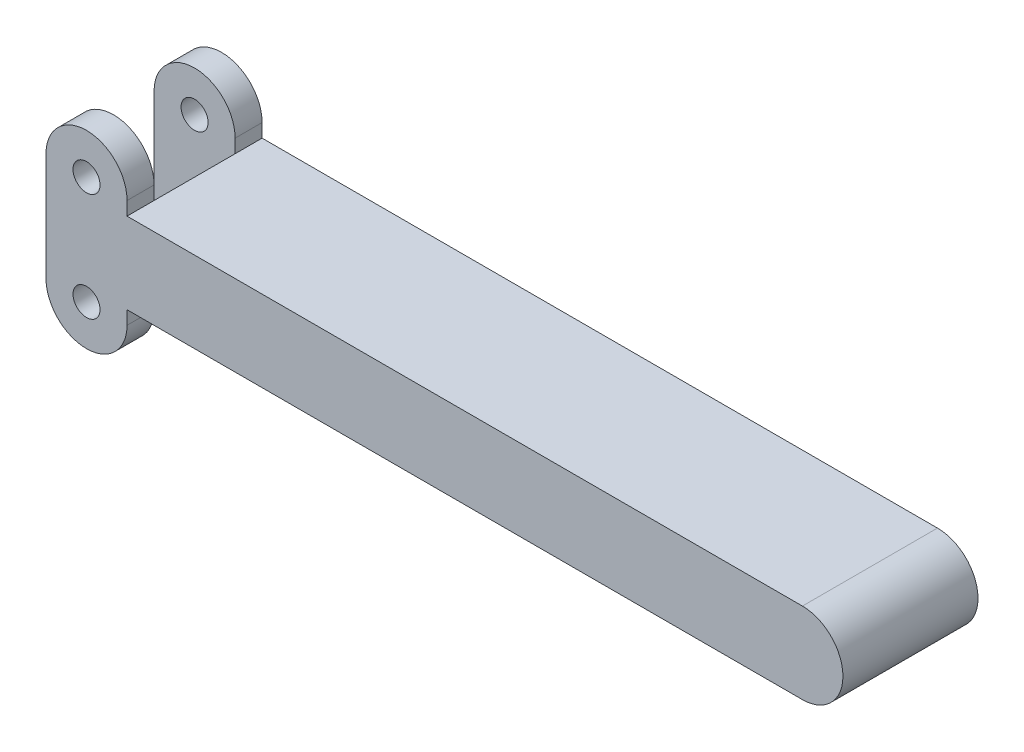
ISO-10303-21;
HEADER;
FILE_DESCRIPTION(('STEP AP214'),'2;1');
FILE_NAME('part.step','',(''),(''),'','','');
FILE_SCHEMA(('AUTOMOTIVE_DESIGN { 1 0 10303 214 1 1 1 1 }'));
ENDSEC;
DATA;
#1=APPLICATION_CONTEXT('core data for automotive mechanical design processes');
#2=APPLICATION_PROTOCOL_DEFINITION('international standard','automotive_design',2000,#1);
#3=PRODUCT_CONTEXT('',#1,'mechanical');
#4=PRODUCT('Part','Part','',(#3));
#5=PRODUCT_RELATED_PRODUCT_CATEGORY('part','',(#4));
#6=PRODUCT_DEFINITION_FORMATION('','',#4);
#7=PRODUCT_DEFINITION_CONTEXT('part definition',#1,'design');
#8=PRODUCT_DEFINITION('design','',#6,#7);
#9=PRODUCT_DEFINITION_SHAPE('','',#8);
#10=(LENGTH_UNIT() NAMED_UNIT(*) SI_UNIT(.MILLI.,.METRE.));
#11=(NAMED_UNIT(*) PLANE_ANGLE_UNIT() SI_UNIT($,.RADIAN.));
#12=(NAMED_UNIT(*) SI_UNIT($,.STERADIAN.) SOLID_ANGLE_UNIT());
#13=UNCERTAINTY_MEASURE_WITH_UNIT(LENGTH_MEASURE(1.E-05),#10,'distance_accuracy_value','');
#14=(GEOMETRIC_REPRESENTATION_CONTEXT(3) GLOBAL_UNCERTAINTY_ASSIGNED_CONTEXT((#13)) GLOBAL_UNIT_ASSIGNED_CONTEXT((#10,
#11,#12)) REPRESENTATION_CONTEXT('',''));
#15=CARTESIAN_POINT('',(0.,0.,0.));
#16=DIRECTION('',(0.,0.,1.));
#17=DIRECTION('',(1.,0.,0.));
#18=AXIS2_PLACEMENT_3D('',#15,#16,#17);
#19=CARTESIAN_POINT('',(9.525,0.,31.75));
#20=DIRECTION('',(-1.,0.,0.));
#21=DIRECTION('',(0.,-1.,0.));
#22=AXIS2_PLACEMENT_3D('',#19,#20,#21);
#23=PLANE('',#22);
#24=DIRECTION('',(0.,-1.,0.));
#25=VECTOR('',#24,1.);
#26=CARTESIAN_POINT('',(9.525,0.,25.4));
#27=LINE('',#26,#25);
#28=CARTESIAN_POINT('',(9.525,25.4,25.4));
#29=VERTEX_POINT('',#28);
#30=CARTESIAN_POINT('',(9.525,22.225,25.4));
#31=VERTEX_POINT('',#30);
#32=EDGE_CURVE('E188',#29,#31,#27,.T.);
#33=ORIENTED_EDGE('',*,*,#32,.F.);
#34=DIRECTION('',(0.,0.,-1.));
#35=VECTOR('',#34,1.);
#36=CARTESIAN_POINT('',(9.525,25.4,31.75));
#37=LINE('',#36,#35);
#38=CARTESIAN_POINT('',(9.525,25.4,31.75));
#39=VERTEX_POINT('',#38);
#40=EDGE_CURVE('E213',#39,#29,#37,.T.);
#41=ORIENTED_EDGE('',*,*,#40,.F.);
#42=DIRECTION('',(0.,1.,0.));
#43=VECTOR('',#42,1.);
#44=CARTESIAN_POINT('',(9.525,0.,31.75));
#45=LINE('',#44,#43);
#46=CARTESIAN_POINT('',(9.525,22.225,31.75));
#47=VERTEX_POINT('',#46);
#48=EDGE_CURVE('E141',#47,#39,#45,.T.);
#49=ORIENTED_EDGE('',*,*,#48,.F.);
#50=DIRECTION('',(0.,0.,-1.));
#51=VECTOR('',#50,1.);
#52=CARTESIAN_POINT('',(9.525,22.225,31.75));
#53=LINE('',#52,#51);
#54=EDGE_CURVE('E44',#47,#31,#53,.T.);
#55=ORIENTED_EDGE('',*,*,#54,.T.);
#56=EDGE_LOOP('',(#33,#41,#49,#55));
#57=FACE_BOUND('',#56,.T.);
#58=ADVANCED_FACE('F35',(#57),#23,.F.);
#59=CARTESIAN_POINT('',(0.,25.4,31.75));
#60=DIRECTION('',(0.,0.,-1.));
#61=DIRECTION('',(-1.,0.,0.));
#62=AXIS2_PLACEMENT_3D('',#59,#60,#61);
#63=CYLINDRICAL_SURFACE('',#62,9.525);
#64=CARTESIAN_POINT('',(0.,25.4,25.4));
#65=DIRECTION('',(0.,0.,-1.));
#66=DIRECTION('',(0.,1.,0.));
#67=AXIS2_PLACEMENT_3D('',#64,#65,#66);
#68=CIRCLE('',#67,9.525);
#69=CARTESIAN_POINT('',(-9.525,25.4,25.4));
#70=VERTEX_POINT('',#69);
#71=EDGE_CURVE('E161',#70,#29,#68,.T.);
#72=ORIENTED_EDGE('',*,*,#71,.F.);
#73=DIRECTION('',(0.,0.,-1.));
#74=VECTOR('',#73,1.);
#75=CARTESIAN_POINT('',(-9.52500000000001,25.4,31.75));
#76=LINE('',#75,#74);
#77=CARTESIAN_POINT('',(-9.52500000000001,25.4,31.75));
#78=VERTEX_POINT('',#77);
#79=EDGE_CURVE('E259',#78,#70,#76,.T.);
#80=ORIENTED_EDGE('',*,*,#79,.F.);
#81=CARTESIAN_POINT('',(0.,25.4,31.75));
#82=DIRECTION('',(0.,0.,1.));
#83=DIRECTION('',(1.,0.,0.));
#84=AXIS2_PLACEMENT_3D('',#81,#82,#83);
#85=CIRCLE('',#84,9.525);
#86=EDGE_CURVE('E146',#39,#78,#85,.T.);
#87=ORIENTED_EDGE('',*,*,#86,.F.);
#88=ORIENTED_EDGE('',*,*,#40,.T.);
#89=EDGE_LOOP('',(#72,#80,#87,#88));
#90=FACE_BOUND('',#89,.T.);
#91=ADVANCED_FACE('F315',(#90),#63,.T.);
#92=CARTESIAN_POINT('',(0.,25.4,6.35));
#93=DIRECTION('',(0.,0.,-1.));
#94=DIRECTION('',(0.,1.,0.));
#95=AXIS2_PLACEMENT_3D('',#92,#93,#94);
#96=CIRCLE('',#95,9.525);
#97=CARTESIAN_POINT('',(-9.525,25.4,6.35));
#98=VERTEX_POINT('',#97);
#99=CARTESIAN_POINT('',(9.525,25.4,6.35));
#100=VERTEX_POINT('',#99);
#101=EDGE_CURVE('E168',#98,#100,#96,.T.);
#102=ORIENTED_EDGE('',*,*,#101,.T.);
#103=CARTESIAN_POINT('',(9.525,25.4,0.));
#104=VERTEX_POINT('',#103);
#105=EDGE_CURVE('E227',#100,#104,#37,.T.);
#106=ORIENTED_EDGE('',*,*,#105,.T.);
#107=CARTESIAN_POINT('',(0.,25.4,0.));
#108=DIRECTION('',(0.,0.,1.));
#109=DIRECTION('',(1.,0.,0.));
#110=AXIS2_PLACEMENT_3D('',#107,#108,#109);
#111=CIRCLE('',#110,9.525);
#112=CARTESIAN_POINT('',(-9.52500000000001,25.4,0.));
#113=VERTEX_POINT('',#112);
#114=EDGE_CURVE('E271',#104,#113,#111,.T.);
#115=ORIENTED_EDGE('',*,*,#114,.T.);
#116=EDGE_CURVE('E258',#98,#113,#76,.T.);
#117=ORIENTED_EDGE('',*,*,#116,.F.);
#118=EDGE_LOOP('',(#102,#106,#115,#117));
#119=FACE_BOUND('',#118,.T.);
#120=ADVANCED_FACE('F272',(#119),#63,.T.);
#121=CARTESIAN_POINT('',(-9.525,0.,31.75));
#122=DIRECTION('',(-1.,0.,0.));
#123=DIRECTION('',(0.,-1.,0.));
#124=AXIS2_PLACEMENT_3D('',#121,#122,#123);
#125=PLANE('',#124);
#126=ORIENTED_EDGE('',*,*,#79,.T.);
#127=DIRECTION('',(0.,-1.,0.));
#128=VECTOR('',#127,1.);
#129=CARTESIAN_POINT('',(-9.525,0.,25.4));
#130=LINE('',#129,#128);
#131=CARTESIAN_POINT('',(-9.525,0.,25.4));
#132=VERTEX_POINT('',#131);
#133=EDGE_CURVE('E182',#70,#132,#130,.T.);
#134=ORIENTED_EDGE('',*,*,#133,.T.);
#135=DIRECTION('',(0.,0.,-1.));
#136=VECTOR('',#135,1.);
#137=CARTESIAN_POINT('',(-9.525,0.,31.75));
#138=LINE('',#137,#136);
#139=CARTESIAN_POINT('',(-9.525,0.,31.75));
#140=VERTEX_POINT('',#139);
#141=EDGE_CURVE('E257',#140,#132,#138,.T.);
#142=ORIENTED_EDGE('',*,*,#141,.F.);
#143=DIRECTION('',(0.,1.,0.));
#144=VECTOR('',#143,1.);
#145=CARTESIAN_POINT('',(-9.525,0.,31.75));
#146=LINE('',#145,#144);
#147=EDGE_CURVE('E122',#140,#78,#146,.T.);
#148=ORIENTED_EDGE('',*,*,#147,.T.);
#149=EDGE_LOOP('',(#126,#134,#142,#148));
#150=FACE_BOUND('',#149,.T.);
#151=ADVANCED_FACE('F341',(#150),#125,.T.);
#152=CARTESIAN_POINT('',(0.,0.,31.75));
#153=DIRECTION('',(0.,0.,-1.));
#154=DIRECTION('',(-1.,0.,0.));
#155=AXIS2_PLACEMENT_3D('',#152,#153,#154);
#156=CYLINDRICAL_SURFACE('',#155,9.525);
#157=CARTESIAN_POINT('',(0.,0.,25.4));
#158=DIRECTION('',(0.,0.,-1.));
#159=DIRECTION('',(0.,1.,0.));
#160=AXIS2_PLACEMENT_3D('',#157,#158,#159);
#161=CIRCLE('',#160,9.525);
#162=CARTESIAN_POINT('',(9.525,0.,25.4));
#163=VERTEX_POINT('',#162);
#164=EDGE_CURVE('E131',#163,#132,#161,.T.);
#165=ORIENTED_EDGE('',*,*,#164,.F.);
#166=DIRECTION('',(0.,0.,-1.));
#167=VECTOR('',#166,1.);
#168=CARTESIAN_POINT('',(9.525,0.,31.75));
#169=LINE('',#168,#167);
#170=CARTESIAN_POINT('',(9.525,0.,31.75));
#171=VERTEX_POINT('',#170);
#172=EDGE_CURVE('E128',#171,#163,#169,.T.);
#173=ORIENTED_EDGE('',*,*,#172,.F.);
#174=CARTESIAN_POINT('',(0.,0.,31.75));
#175=DIRECTION('',(0.,0.,1.));
#176=DIRECTION('',(1.,0.,0.));
#177=AXIS2_PLACEMENT_3D('',#174,#175,#176);
#178=CIRCLE('',#177,9.525);
#179=EDGE_CURVE('E114',#140,#171,#178,.T.);
#180=ORIENTED_EDGE('',*,*,#179,.F.);
#181=ORIENTED_EDGE('',*,*,#141,.T.);
#182=EDGE_LOOP('',(#165,#173,#180,#181));
#183=FACE_BOUND('',#182,.T.);
#184=ADVANCED_FACE('F129',(#183),#156,.T.);
#185=CARTESIAN_POINT('',(9.525,3.175,25.4));
#186=VERTEX_POINT('',#185);
#187=EDGE_CURVE('E181',#186,#163,#27,.T.);
#188=ORIENTED_EDGE('',*,*,#187,.F.);
#189=DIRECTION('',(0.,0.,-1.));
#190=VECTOR('',#189,1.);
#191=CARTESIAN_POINT('',(9.525,3.175,31.75));
#192=LINE('',#191,#190);
#193=CARTESIAN_POINT('',(9.525,3.175,31.75));
#194=VERTEX_POINT('',#193);
#195=EDGE_CURVE('E139',#194,#186,#192,.T.);
#196=ORIENTED_EDGE('',*,*,#195,.F.);
#197=EDGE_CURVE('E119',#171,#194,#45,.T.);
#198=ORIENTED_EDGE('',*,*,#197,.F.);
#199=ORIENTED_EDGE('',*,*,#172,.T.);
#200=EDGE_LOOP('',(#188,#196,#198,#199));
#201=FACE_BOUND('',#200,.T.);
#202=ADVANCED_FACE('F137',(#201),#23,.F.);
#203=CARTESIAN_POINT('',(0.,0.,31.75));
#204=DIRECTION('',(0.,0.,-1.));
#205=DIRECTION('',(-1.,0.,0.));
#206=AXIS2_PLACEMENT_3D('',#203,#204,#205);
#207=CYLINDRICAL_SURFACE('',#206,3.175);
#208=CARTESIAN_POINT('',(0.,0.,31.75));
#209=DIRECTION('',(0.,0.,1.));
#210=DIRECTION('',(1.,0.,0.));
#211=AXIS2_PLACEMENT_3D('',#208,#209,#210);
#212=CIRCLE('',#211,3.175);
#213=CARTESIAN_POINT('',(3.175,0.,31.75));
#214=VERTEX_POINT('',#213);
#215=EDGE_CURVE('E142',#214,#214,#212,.T.);
#216=ORIENTED_EDGE('',*,*,#215,.T.);
#217=EDGE_LOOP('',(#216));
#218=FACE_BOUND('',#217,.T.);
#219=CARTESIAN_POINT('',(0.,0.,25.4));
#220=DIRECTION('',(0.,0.,-1.));
#221=DIRECTION('',(0.,1.,0.));
#222=AXIS2_PLACEMENT_3D('',#219,#220,#221);
#223=CIRCLE('',#222,3.175);
#224=CARTESIAN_POINT('',(0.,3.175,25.4));
#225=VERTEX_POINT('',#224);
#226=EDGE_CURVE('E165',#225,#225,#223,.T.);
#227=ORIENTED_EDGE('',*,*,#226,.T.);
#228=EDGE_LOOP('',(#227));
#229=FACE_BOUND('',#228,.T.);
#230=ADVANCED_FACE('F312',(#218,#229),#207,.F.);
#231=CARTESIAN_POINT('',(0.,25.4,31.75));
#232=DIRECTION('',(0.,0.,-1.));
#233=DIRECTION('',(-1.,0.,0.));
#234=AXIS2_PLACEMENT_3D('',#231,#232,#233);
#235=CYLINDRICAL_SURFACE('',#234,3.175);
#236=CARTESIAN_POINT('',(0.,25.4,31.75));
#237=DIRECTION('',(0.,0.,1.));
#238=DIRECTION('',(1.,0.,0.));
#239=AXIS2_PLACEMENT_3D('',#236,#237,#238);
#240=CIRCLE('',#239,3.175);
#241=CARTESIAN_POINT('',(3.17499999999999,25.4,31.75));
#242=VERTEX_POINT('',#241);
#243=EDGE_CURVE('E353',#242,#242,#240,.T.);
#244=ORIENTED_EDGE('',*,*,#243,.T.);
#245=EDGE_LOOP('',(#244));
#246=FACE_BOUND('',#245,.T.);
#247=CARTESIAN_POINT('',(0.,25.4,25.4));
#248=DIRECTION('',(0.,0.,-1.));
#249=DIRECTION('',(0.,1.,0.));
#250=AXIS2_PLACEMENT_3D('',#247,#248,#249);
#251=CIRCLE('',#250,3.175);
#252=CARTESIAN_POINT('',(0.,28.575,25.4));
#253=VERTEX_POINT('',#252);
#254=EDGE_CURVE('E39',#253,#253,#251,.T.);
#255=ORIENTED_EDGE('',*,*,#254,.T.);
#256=EDGE_LOOP('',(#255));
#257=FACE_BOUND('',#256,.T.);
#258=ADVANCED_FACE('F301',(#246,#257),#235,.F.);
#259=CARTESIAN_POINT('',(168.275,12.7,31.75));
#260=DIRECTION('',(0.,0.,-1.));
#261=DIRECTION('',(-1.,0.,0.));
#262=AXIS2_PLACEMENT_3D('',#259,#260,#261);
#263=CYLINDRICAL_SURFACE('',#262,9.525);
#264=CARTESIAN_POINT('',(168.275,12.7,0.));
#265=DIRECTION('',(0.,0.,1.));
#266=DIRECTION('',(1.,0.,0.));
#267=AXIS2_PLACEMENT_3D('',#264,#265,#266);
#268=CIRCLE('',#267,9.525);
#269=CARTESIAN_POINT('',(168.275,22.225,0.));
#270=VERTEX_POINT('',#269);
#271=CARTESIAN_POINT('',(168.275,3.175,0.));
#272=VERTEX_POINT('',#271);
#273=EDGE_CURVE('E160',#270,#272,#268,.F.);
#274=ORIENTED_EDGE('',*,*,#273,.F.);
#275=DIRECTION('',(0.,0.,-1.));
#276=VECTOR('',#275,1.);
#277=CARTESIAN_POINT('',(168.275,22.225,31.75));
#278=LINE('',#277,#276);
#279=CARTESIAN_POINT('',(168.275,22.225,31.75));
#280=VERTEX_POINT('',#279);
#281=EDGE_CURVE('E11',#280,#270,#278,.T.);
#282=ORIENTED_EDGE('',*,*,#281,.F.);
#283=CARTESIAN_POINT('',(168.275,12.7,31.75));
#284=DIRECTION('',(0.,0.,1.));
#285=DIRECTION('',(1.,0.,0.));
#286=AXIS2_PLACEMENT_3D('',#283,#284,#285);
#287=CIRCLE('',#286,9.525);
#288=CARTESIAN_POINT('',(168.275,3.175,31.75));
#289=VERTEX_POINT('',#288);
#290=EDGE_CURVE('E152',#280,#289,#287,.F.);
#291=ORIENTED_EDGE('',*,*,#290,.T.);
#292=DIRECTION('',(0.,0.,-1.));
#293=VECTOR('',#292,1.);
#294=CARTESIAN_POINT('',(168.275,3.175,31.75));
#295=LINE('',#294,#293);
#296=EDGE_CURVE('E93',#289,#272,#295,.T.);
#297=ORIENTED_EDGE('',*,*,#296,.T.);
#298=EDGE_LOOP('',(#274,#282,#291,#297));
#299=FACE_BOUND('',#298,.T.);
#300=ADVANCED_FACE('F37',(#299),#263,.T.);
#301=CARTESIAN_POINT('',(0.,22.225,31.75));
#302=DIRECTION('',(0.,1.,0.));
#303=DIRECTION('',(0.,0.,1.));
#304=AXIS2_PLACEMENT_3D('',#301,#302,#303);
#305=PLANE('',#304);
#306=DIRECTION('',(1.,0.,0.));
#307=VECTOR('',#306,1.);
#308=CARTESIAN_POINT('',(0.,22.225,0.));
#309=LINE('',#308,#307);
#310=CARTESIAN_POINT('',(9.525,22.225,0.));
#311=VERTEX_POINT('',#310);
#312=EDGE_CURVE('E349',#311,#270,#309,.T.);
#313=ORIENTED_EDGE('',*,*,#312,.F.);
#314=CARTESIAN_POINT('',(9.525,22.225,6.35));
#315=VERTEX_POINT('',#314);
#316=EDGE_CURVE('E211',#315,#311,#53,.T.);
#317=ORIENTED_EDGE('',*,*,#316,.F.);
#318=DIRECTION('',(0.,0.,1.));
#319=VECTOR('',#318,1.);
#320=CARTESIAN_POINT('',(9.525,22.225,31.75));
#321=LINE('',#320,#319);
#322=EDGE_CURVE('E157',#315,#31,#321,.T.);
#323=ORIENTED_EDGE('',*,*,#322,.T.);
#324=ORIENTED_EDGE('',*,*,#54,.F.);
#325=DIRECTION('',(1.,0.,0.));
#326=VECTOR('',#325,1.);
#327=CARTESIAN_POINT('',(0.,22.225,31.75));
#328=LINE('',#327,#326);
#329=EDGE_CURVE('E147',#47,#280,#328,.T.);
#330=ORIENTED_EDGE('',*,*,#329,.T.);
#331=ORIENTED_EDGE('',*,*,#281,.T.);
#332=EDGE_LOOP('',(#313,#317,#323,#324,#330,#331));
#333=FACE_BOUND('',#332,.T.);
#334=ADVANCED_FACE('F209',(#333),#305,.T.);
#335=ORIENTED_EDGE('',*,*,#105,.F.);
#336=DIRECTION('',(0.,-1.,0.));
#337=VECTOR('',#336,1.);
#338=CARTESIAN_POINT('',(9.525,0.,6.35));
#339=LINE('',#338,#337);
#340=EDGE_CURVE('E189',#100,#315,#339,.T.);
#341=ORIENTED_EDGE('',*,*,#340,.T.);
#342=ORIENTED_EDGE('',*,*,#316,.T.);
#343=DIRECTION('',(0.,1.,0.));
#344=VECTOR('',#343,1.);
#345=CARTESIAN_POINT('',(9.525,0.,0.));
#346=LINE('',#345,#344);
#347=EDGE_CURVE('E274',#311,#104,#346,.T.);
#348=ORIENTED_EDGE('',*,*,#347,.T.);
#349=EDGE_LOOP('',(#335,#341,#342,#348));
#350=FACE_BOUND('',#349,.T.);
#351=ADVANCED_FACE('F223',(#350),#23,.F.);
#352=DIRECTION('',(0.,-1.,0.));
#353=VECTOR('',#352,1.);
#354=CARTESIAN_POINT('',(-9.525,0.,6.35));
#355=LINE('',#354,#353);
#356=CARTESIAN_POINT('',(-9.525,0.,6.35));
#357=VERTEX_POINT('',#356);
#358=EDGE_CURVE('E178',#98,#357,#355,.T.);
#359=ORIENTED_EDGE('',*,*,#358,.F.);
#360=ORIENTED_EDGE('',*,*,#116,.T.);
#361=DIRECTION('',(0.,1.,0.));
#362=VECTOR('',#361,1.);
#363=CARTESIAN_POINT('',(-9.525,0.,0.));
#364=LINE('',#363,#362);
#365=CARTESIAN_POINT('',(-9.525,0.,0.));
#366=VERTEX_POINT('',#365);
#367=EDGE_CURVE('E269',#366,#113,#364,.T.);
#368=ORIENTED_EDGE('',*,*,#367,.F.);
#369=EDGE_CURVE('E134',#357,#366,#138,.T.);
#370=ORIENTED_EDGE('',*,*,#369,.F.);
#371=EDGE_LOOP('',(#359,#360,#368,#370));
#372=FACE_BOUND('',#371,.T.);
#373=ADVANCED_FACE('F266',(#372),#125,.T.);
#374=CARTESIAN_POINT('',(9.525,0.,6.35));
#375=VERTEX_POINT('',#374);
#376=CARTESIAN_POINT('',(9.525,0.,0.));
#377=VERTEX_POINT('',#376);
#378=EDGE_CURVE('E135',#375,#377,#169,.T.);
#379=ORIENTED_EDGE('',*,*,#378,.F.);
#380=CARTESIAN_POINT('',(0.,0.,6.35));
#381=DIRECTION('',(0.,0.,-1.));
#382=DIRECTION('',(0.,1.,0.));
#383=AXIS2_PLACEMENT_3D('',#380,#381,#382);
#384=CIRCLE('',#383,9.525);
#385=EDGE_CURVE('E171',#375,#357,#384,.T.);
#386=ORIENTED_EDGE('',*,*,#385,.T.);
#387=ORIENTED_EDGE('',*,*,#369,.T.);
#388=CARTESIAN_POINT('',(0.,0.,0.));
#389=DIRECTION('',(0.,0.,1.));
#390=DIRECTION('',(1.,0.,0.));
#391=AXIS2_PLACEMENT_3D('',#388,#389,#390);
#392=CIRCLE('',#391,9.525);
#393=EDGE_CURVE('E282',#366,#377,#392,.T.);
#394=ORIENTED_EDGE('',*,*,#393,.T.);
#395=EDGE_LOOP('',(#379,#386,#387,#394));
#396=FACE_BOUND('',#395,.T.);
#397=ADVANCED_FACE('F326',(#396),#156,.T.);
#398=CARTESIAN_POINT('',(9.525,3.175,6.35));
#399=VERTEX_POINT('',#398);
#400=CARTESIAN_POINT('',(9.525,3.175,0.));
#401=VERTEX_POINT('',#400);
#402=EDGE_CURVE('E252',#399,#401,#192,.T.);
#403=ORIENTED_EDGE('',*,*,#402,.F.);
#404=EDGE_CURVE('E185',#399,#375,#339,.T.);
#405=ORIENTED_EDGE('',*,*,#404,.T.);
#406=ORIENTED_EDGE('',*,*,#378,.T.);
#407=EDGE_CURVE('E284',#377,#401,#346,.T.);
#408=ORIENTED_EDGE('',*,*,#407,.T.);
#409=EDGE_LOOP('',(#403,#405,#406,#408));
#410=FACE_BOUND('',#409,.T.);
#411=ADVANCED_FACE('F317',(#410),#23,.F.);
#412=CARTESIAN_POINT('',(0.,0.,6.35));
#413=DIRECTION('',(0.,0.,-1.));
#414=DIRECTION('',(0.,1.,0.));
#415=AXIS2_PLACEMENT_3D('',#412,#413,#414);
#416=CIRCLE('',#415,3.175);
#417=CARTESIAN_POINT('',(0.,3.175,6.35));
#418=VERTEX_POINT('',#417);
#419=EDGE_CURVE('E174',#418,#418,#416,.T.);
#420=ORIENTED_EDGE('',*,*,#419,.F.);
#421=EDGE_LOOP('',(#420));
#422=FACE_BOUND('',#421,.T.);
#423=CARTESIAN_POINT('',(0.,0.,0.));
#424=DIRECTION('',(0.,0.,1.));
#425=DIRECTION('',(1.,0.,0.));
#426=AXIS2_PLACEMENT_3D('',#423,#424,#425);
#427=CIRCLE('',#426,3.175);
#428=CARTESIAN_POINT('',(3.175,0.,0.));
#429=VERTEX_POINT('',#428);
#430=EDGE_CURVE('E290',#429,#429,#427,.T.);
#431=ORIENTED_EDGE('',*,*,#430,.F.);
#432=EDGE_LOOP('',(#431));
#433=FACE_BOUND('',#432,.T.);
#434=ADVANCED_FACE('F307',(#422,#433),#207,.F.);
#435=CARTESIAN_POINT('',(0.,3.175,31.75));
#436=DIRECTION('',(0.,1.,0.));
#437=DIRECTION('',(0.,0.,1.));
#438=AXIS2_PLACEMENT_3D('',#435,#436,#437);
#439=PLANE('',#438);
#440=DIRECTION('',(1.,0.,0.));
#441=VECTOR('',#440,1.);
#442=CARTESIAN_POINT('',(0.,3.175,0.));
#443=LINE('',#442,#441);
#444=EDGE_CURVE('E288',#401,#272,#443,.T.);
#445=ORIENTED_EDGE('',*,*,#444,.T.);
#446=ORIENTED_EDGE('',*,*,#296,.F.);
#447=DIRECTION('',(1.,0.,0.));
#448=VECTOR('',#447,1.);
#449=CARTESIAN_POINT('',(0.,3.175,31.75));
#450=LINE('',#449,#448);
#451=EDGE_CURVE('E61',#194,#289,#450,.T.);
#452=ORIENTED_EDGE('',*,*,#451,.F.);
#453=ORIENTED_EDGE('',*,*,#195,.T.);
#454=EDGE_CURVE('E249',#186,#399,#192,.T.);
#455=ORIENTED_EDGE('',*,*,#454,.T.);
#456=ORIENTED_EDGE('',*,*,#402,.T.);
#457=EDGE_LOOP('',(#445,#446,#452,#453,#455,#456));
#458=FACE_BOUND('',#457,.T.);
#459=ADVANCED_FACE('F298',(#458),#439,.F.);
#460=CARTESIAN_POINT('',(0.,25.4,6.35));
#461=DIRECTION('',(0.,0.,-1.));
#462=DIRECTION('',(0.,1.,0.));
#463=AXIS2_PLACEMENT_3D('',#460,#461,#462);
#464=CIRCLE('',#463,3.175);
#465=CARTESIAN_POINT('',(0.,28.575,6.35));
#466=VERTEX_POINT('',#465);
#467=EDGE_CURVE('E177',#466,#466,#464,.T.);
#468=ORIENTED_EDGE('',*,*,#467,.F.);
#469=EDGE_LOOP('',(#468));
#470=FACE_BOUND('',#469,.T.);
#471=CARTESIAN_POINT('',(0.,25.4,0.));
#472=DIRECTION('',(0.,0.,1.));
#473=DIRECTION('',(1.,0.,0.));
#474=AXIS2_PLACEMENT_3D('',#471,#472,#473);
#475=CIRCLE('',#474,3.175);
#476=CARTESIAN_POINT('',(3.17499999999999,25.4,0.));
#477=VERTEX_POINT('',#476);
#478=EDGE_CURVE('E154',#477,#477,#475,.T.);
#479=ORIENTED_EDGE('',*,*,#478,.F.);
#480=EDGE_LOOP('',(#479));
#481=FACE_BOUND('',#480,.T.);
#482=ADVANCED_FACE('F296',(#470,#481),#235,.F.);
#483=CARTESIAN_POINT('',(0.,0.,31.75));
#484=DIRECTION('',(0.,0.,1.));
#485=DIRECTION('',(1.,0.,0.));
#486=AXIS2_PLACEMENT_3D('',#483,#484,#485);
#487=PLANE('',#486);
#488=ORIENTED_EDGE('',*,*,#290,.F.);
#489=ORIENTED_EDGE('',*,*,#329,.F.);
#490=ORIENTED_EDGE('',*,*,#48,.T.);
#491=ORIENTED_EDGE('',*,*,#86,.T.);
#492=ORIENTED_EDGE('',*,*,#147,.F.);
#493=ORIENTED_EDGE('',*,*,#179,.T.);
#494=ORIENTED_EDGE('',*,*,#197,.T.);
#495=ORIENTED_EDGE('',*,*,#451,.T.);
#496=EDGE_LOOP('',(#488,#489,#490,#491,#492,#493,#494,#495));
#497=FACE_BOUND('',#496,.T.);
#498=ORIENTED_EDGE('',*,*,#215,.F.);
#499=EDGE_LOOP('',(#498));
#500=FACE_BOUND('',#499,.T.);
#501=ORIENTED_EDGE('',*,*,#243,.F.);
#502=EDGE_LOOP('',(#501));
#503=FACE_BOUND('',#502,.T.);
#504=ADVANCED_FACE('F116',(#497,#500,#503),#487,.T.);
#505=CARTESIAN_POINT('',(0.,0.,0.));
#506=DIRECTION('',(0.,0.,1.));
#507=DIRECTION('',(1.,0.,0.));
#508=AXIS2_PLACEMENT_3D('',#505,#506,#507);
#509=PLANE('',#508);
#510=ORIENTED_EDGE('',*,*,#273,.T.);
#511=ORIENTED_EDGE('',*,*,#444,.F.);
#512=ORIENTED_EDGE('',*,*,#407,.F.);
#513=ORIENTED_EDGE('',*,*,#393,.F.);
#514=ORIENTED_EDGE('',*,*,#367,.T.);
#515=ORIENTED_EDGE('',*,*,#114,.F.);
#516=ORIENTED_EDGE('',*,*,#347,.F.);
#517=ORIENTED_EDGE('',*,*,#312,.T.);
#518=EDGE_LOOP('',(#510,#511,#512,#513,#514,#515,#516,#517));
#519=FACE_BOUND('',#518,.T.);
#520=ORIENTED_EDGE('',*,*,#430,.T.);
#521=EDGE_LOOP('',(#520));
#522=FACE_BOUND('',#521,.T.);
#523=ORIENTED_EDGE('',*,*,#478,.T.);
#524=EDGE_LOOP('',(#523));
#525=FACE_BOUND('',#524,.T.);
#526=ADVANCED_FACE('F278',(#519,#522,#525),#509,.F.);
#527=CARTESIAN_POINT('',(9.525,0.,0.));
#528=DIRECTION('',(-1.,0.,0.));
#529=DIRECTION('',(0.,0.,1.));
#530=AXIS2_PLACEMENT_3D('',#527,#528,#529);
#531=PLANE('',#530);
#532=EDGE_CURVE('E52',#315,#399,#339,.T.);
#533=ORIENTED_EDGE('',*,*,#532,.T.);
#534=ORIENTED_EDGE('',*,*,#454,.F.);
#535=EDGE_CURVE('E191',#31,#186,#27,.T.);
#536=ORIENTED_EDGE('',*,*,#535,.F.);
#537=ORIENTED_EDGE('',*,*,#322,.F.);
#538=EDGE_LOOP('',(#533,#534,#536,#537));
#539=FACE_BOUND('',#538,.T.);
#540=ADVANCED_FACE('F250',(#539),#531,.T.);
#541=CARTESIAN_POINT('',(9.525,0.,25.4));
#542=DIRECTION('',(0.,0.,-1.));
#543=DIRECTION('',(0.,1.,0.));
#544=AXIS2_PLACEMENT_3D('',#541,#542,#543);
#545=PLANE('',#544);
#546=ORIENTED_EDGE('',*,*,#226,.F.);
#547=EDGE_LOOP('',(#546));
#548=FACE_BOUND('',#547,.T.);
#549=ORIENTED_EDGE('',*,*,#254,.F.);
#550=EDGE_LOOP('',(#549));
#551=FACE_BOUND('',#550,.T.);
#552=ORIENTED_EDGE('',*,*,#71,.T.);
#553=ORIENTED_EDGE('',*,*,#32,.T.);
#554=ORIENTED_EDGE('',*,*,#535,.T.);
#555=ORIENTED_EDGE('',*,*,#187,.T.);
#556=ORIENTED_EDGE('',*,*,#164,.T.);
#557=ORIENTED_EDGE('',*,*,#133,.F.);
#558=EDGE_LOOP('',(#552,#553,#554,#555,#556,#557));
#559=FACE_BOUND('',#558,.T.);
#560=ADVANCED_FACE('F197',(#548,#551,#559),#545,.T.);
#561=CARTESIAN_POINT('',(9.525,0.,6.35));
#562=DIRECTION('',(0.,0.,-1.));
#563=DIRECTION('',(0.,1.,0.));
#564=AXIS2_PLACEMENT_3D('',#561,#562,#563);
#565=PLANE('',#564);
#566=ORIENTED_EDGE('',*,*,#419,.T.);
#567=EDGE_LOOP('',(#566));
#568=FACE_BOUND('',#567,.T.);
#569=ORIENTED_EDGE('',*,*,#467,.T.);
#570=EDGE_LOOP('',(#569));
#571=FACE_BOUND('',#570,.T.);
#572=ORIENTED_EDGE('',*,*,#101,.F.);
#573=ORIENTED_EDGE('',*,*,#358,.T.);
#574=ORIENTED_EDGE('',*,*,#385,.F.);
#575=ORIENTED_EDGE('',*,*,#404,.F.);
#576=ORIENTED_EDGE('',*,*,#532,.F.);
#577=ORIENTED_EDGE('',*,*,#340,.F.);
#578=EDGE_LOOP('',(#572,#573,#574,#575,#576,#577));
#579=FACE_BOUND('',#578,.T.);
#580=ADVANCED_FACE('F232',(#568,#571,#579),#565,.F.);
#581=CLOSED_SHELL('',(#58,#91,#120,#151,#184,#202,#230,#258,#300,#334,#351,#373,#397,#411,#434,
#459,#482,#504,#526,#540,#560,#580));
#582=MANIFOLD_SOLID_BREP('B2',#581);
#583=ADVANCED_BREP_SHAPE_REPRESENTATION('',(#18,#582),#14);
#584=SHAPE_DEFINITION_REPRESENTATION(#9,#583);
ENDSEC;
END-ISO-10303-21;
